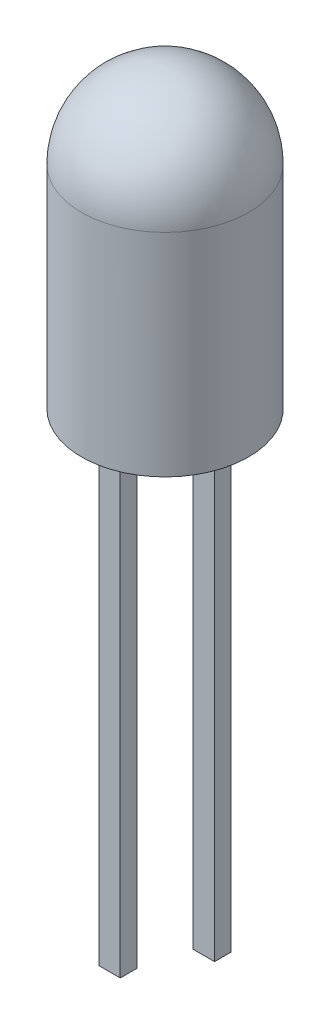
ISO-10303-21;
HEADER;
FILE_DESCRIPTION(('STEP AP214'),'2;1');
FILE_NAME('part.step','',(''),(''),'','','');
FILE_SCHEMA(('AUTOMOTIVE_DESIGN { 1 0 10303 214 1 1 1 1 }'));
ENDSEC;
DATA;
#1=APPLICATION_CONTEXT('core data for automotive mechanical design processes');
#2=APPLICATION_PROTOCOL_DEFINITION('international standard','automotive_design',2000,#1);
#3=PRODUCT_CONTEXT('',#1,'mechanical');
#4=PRODUCT('Part','Part','',(#3));
#5=PRODUCT_RELATED_PRODUCT_CATEGORY('part','',(#4));
#6=PRODUCT_DEFINITION_FORMATION('','',#4);
#7=PRODUCT_DEFINITION_CONTEXT('part definition',#1,'design');
#8=PRODUCT_DEFINITION('design','',#6,#7);
#9=PRODUCT_DEFINITION_SHAPE('','',#8);
#10=(LENGTH_UNIT() NAMED_UNIT(*) SI_UNIT(.MILLI.,.METRE.));
#11=(NAMED_UNIT(*) PLANE_ANGLE_UNIT() SI_UNIT($,.RADIAN.));
#12=(NAMED_UNIT(*) SI_UNIT($,.STERADIAN.) SOLID_ANGLE_UNIT());
#13=UNCERTAINTY_MEASURE_WITH_UNIT(LENGTH_MEASURE(1.E-05),#10,'distance_accuracy_value','');
#14=(GEOMETRIC_REPRESENTATION_CONTEXT(3) GLOBAL_UNCERTAINTY_ASSIGNED_CONTEXT((#13)) GLOBAL_UNIT_ASSIGNED_CONTEXT((#10,
#11,#12)) REPRESENTATION_CONTEXT('',''));
#15=CARTESIAN_POINT('',(0.,0.,0.));
#16=DIRECTION('',(0.,0.,1.));
#17=DIRECTION('',(1.,0.,0.));
#18=AXIS2_PLACEMENT_3D('',#15,#16,#17);
#19=CARTESIAN_POINT('',(-0.0605595659989582,2.80694027615572,0.));
#20=DIRECTION('',(0.,-1.,0.));
#21=DIRECTION('',(1.,0.,0.));
#22=AXIS2_PLACEMENT_3D('',#19,#20,#21);
#23=CYLINDRICAL_SURFACE('',#22,0.189425793844278);
#24=CARTESIAN_POINT('',(-0.0605595659989582,2.80694027615572,0.));
#25=DIRECTION('',(0.,1.,0.));
#26=DIRECTION('',(-1.,0.,0.));
#27=AXIS2_PLACEMENT_3D('',#24,#25,#26);
#28=CIRCLE('',#27,0.189425793844278);
#29=CARTESIAN_POINT('',(-0.249985359843236,2.80694027615572,0.));
#30=VERTEX_POINT('',#29);
#31=EDGE_CURVE('E11',#30,#30,#28,.T.);
#32=ORIENTED_EDGE('',*,*,#31,.F.);
#33=EDGE_LOOP('',(#32));
#34=FACE_BOUND('',#33,.T.);
#35=CARTESIAN_POINT('',(-0.0605595659989582,2.70694027615572,0.));
#36=DIRECTION('',(0.,1.,0.));
#37=DIRECTION('',(-1.,0.,0.));
#38=AXIS2_PLACEMENT_3D('',#35,#36,#37);
#39=CIRCLE('',#38,0.189425793844278);
#40=CARTESIAN_POINT('',(-0.249985359843236,2.70694027615572,0.));
#41=VERTEX_POINT('',#40);
#42=EDGE_CURVE('E52',#41,#41,#39,.T.);
#43=ORIENTED_EDGE('',*,*,#42,.T.);
#44=EDGE_LOOP('',(#43));
#45=FACE_BOUND('',#44,.T.);
#46=ADVANCED_FACE('F49',(#34,#45),#23,.T.);
#47=CARTESIAN_POINT('',(-0.0605595659989582,2.80694027615572,0.));
#48=DIRECTION('',(0.,1.,0.));
#49=DIRECTION('',(-1.,0.,0.));
#50=AXIS2_PLACEMENT_3D('',#47,#48,#49);
#51=PLANE('',#50);
#52=ORIENTED_EDGE('',*,*,#31,.T.);
#53=EDGE_LOOP('',(#52));
#54=FACE_BOUND('',#53,.T.);
#55=ADVANCED_FACE('F64',(#54),#51,.T.);
#56=CARTESIAN_POINT('',(-0.0605595659989582,2.70694027615572,0.));
#57=DIRECTION('',(0.,1.,0.));
#58=DIRECTION('',(-1.,0.,0.));
#59=AXIS2_PLACEMENT_3D('',#56,#57,#58);
#60=PLANE('',#59);
#61=ORIENTED_EDGE('',*,*,#42,.F.);
#62=EDGE_LOOP('',(#61));
#63=FACE_BOUND('',#62,.T.);
#64=ADVANCED_FACE('F62',(#63),#60,.F.);
#65=CLOSED_SHELL('',(#46,#55,#64));
#66=MANIFOLD_SOLID_BREP('B2',#65);
#67=CARTESIAN_POINT('',(0.654816514950922,-8.,0.149242281114547));
#68=DIRECTION('',(1.,0.,0.));
#69=DIRECTION('',(0.,0.,-1.));
#70=AXIS2_PLACEMENT_3D('',#67,#68,#69);
#71=PLANE('',#70);
#72=DIRECTION('',(0.,1.,0.));
#73=VECTOR('',#72,1.);
#74=CARTESIAN_POINT('',(0.654816514950922,-8.,0.149242281114547));
#75=LINE('',#74,#73);
#76=CARTESIAN_POINT('',(0.654816514950922,-8.,0.149242281114547));
#77=VERTEX_POINT('',#76);
#78=CARTESIAN_POINT('',(0.654816514950922,0.,0.149242281114547));
#79=VERTEX_POINT('',#78);
#80=EDGE_CURVE('E495',#77,#79,#75,.T.);
#81=ORIENTED_EDGE('',*,*,#80,.T.);
#82=DIRECTION('',(0.,0.,-1.));
#83=VECTOR('',#82,1.);
#84=CARTESIAN_POINT('',(0.654816514950922,0.,0.15));
#85=LINE('',#84,#83);
#86=CARTESIAN_POINT('',(0.654816514950922,0.,0.15));
#87=VERTEX_POINT('',#86);
#88=EDGE_CURVE('E251',#87,#79,#85,.T.);
#89=ORIENTED_EDGE('',*,*,#88,.F.);
#90=DIRECTION('',(0.,-1.,0.));
#91=VECTOR('',#90,1.);
#92=CARTESIAN_POINT('',(0.654816514950922,1.55125542870119,0.15));
#93=LINE('',#92,#91);
#94=CARTESIAN_POINT('',(0.654816514950922,1.55125542870119,0.15));
#95=VERTEX_POINT('',#94);
#96=EDGE_CURVE('E325',#95,#87,#93,.T.);
#97=ORIENTED_EDGE('',*,*,#96,.F.);
#98=DIRECTION('',(0.,0.,-1.));
#99=VECTOR('',#98,1.);
#100=CARTESIAN_POINT('',(0.654816514950922,1.55125542870119,0.15));
#101=LINE('',#100,#99);
#102=CARTESIAN_POINT('',(0.654816514950922,1.55125542870119,-0.15));
#103=VERTEX_POINT('',#102);
#104=EDGE_CURVE('E246',#95,#103,#101,.T.);
#105=ORIENTED_EDGE('',*,*,#104,.T.);
#106=DIRECTION('',(0.,-1.,0.));
#107=VECTOR('',#106,1.);
#108=CARTESIAN_POINT('',(0.654816514950922,1.55125542870119,-0.15));
#109=LINE('',#108,#107);
#110=CARTESIAN_POINT('',(0.654816514950922,0.,-0.15));
#111=VERTEX_POINT('',#110);
#112=EDGE_CURVE('E269',#103,#111,#109,.T.);
#113=ORIENTED_EDGE('',*,*,#112,.T.);
#114=CARTESIAN_POINT('',(0.654816514950922,0.,-0.149242281114547));
#115=VERTEX_POINT('',#114);
#116=EDGE_CURVE('E235',#115,#111,#85,.T.);
#117=ORIENTED_EDGE('',*,*,#116,.F.);
#118=DIRECTION('',(0.,1.,0.));
#119=VECTOR('',#118,1.);
#120=CARTESIAN_POINT('',(0.654816514950922,-8.,-0.149242281114547));
#121=LINE('',#120,#119);
#122=CARTESIAN_POINT('',(0.654816514950922,-8.,-0.149242281114547));
#123=VERTEX_POINT('',#122);
#124=EDGE_CURVE('E47',#123,#115,#121,.T.);
#125=ORIENTED_EDGE('',*,*,#124,.F.);
#126=DIRECTION('',(0.,0.,-1.));
#127=VECTOR('',#126,1.);
#128=CARTESIAN_POINT('',(0.654816514950922,-8.,0.149242281114547));
#129=LINE('',#128,#127);
#130=EDGE_CURVE('E486',#77,#123,#129,.T.);
#131=ORIENTED_EDGE('',*,*,#130,.F.);
#132=EDGE_LOOP('',(#81,#89,#97,#105,#113,#117,#125,#131));
#133=FACE_BOUND('',#132,.T.);
#134=ADVANCED_FACE('F99',(#133),#71,.F.);
#135=CARTESIAN_POINT('',(1.03787854119038,-8.,-0.149242281114547));
#136=DIRECTION('',(0.,0.,1.));
#137=DIRECTION('',(1.,0.,0.));
#138=AXIS2_PLACEMENT_3D('',#135,#136,#137);
#139=PLANE('',#138);
#140=DIRECTION('',(1.,0.,0.));
#141=VECTOR('',#140,1.);
#142=CARTESIAN_POINT('',(1.03787854119038,0.,-0.149242281114547));
#143=LINE('',#142,#141);
#144=CARTESIAN_POINT('',(1.03787854119038,0.,-0.149242281114547));
#145=VERTEX_POINT('',#144);
#146=EDGE_CURVE('E222',#115,#145,#143,.T.);
#147=ORIENTED_EDGE('',*,*,#146,.T.);
#148=DIRECTION('',(0.,1.,0.));
#149=VECTOR('',#148,1.);
#150=CARTESIAN_POINT('',(1.03787854119038,-8.,-0.149242281114547));
#151=LINE('',#150,#149);
#152=CARTESIAN_POINT('',(1.03787854119038,-8.,-0.149242281114547));
#153=VERTEX_POINT('',#152);
#154=EDGE_CURVE('E108',#153,#145,#151,.T.);
#155=ORIENTED_EDGE('',*,*,#154,.F.);
#156=DIRECTION('',(1.,0.,0.));
#157=VECTOR('',#156,1.);
#158=CARTESIAN_POINT('',(1.03787854119038,-8.,-0.149242281114547));
#159=LINE('',#158,#157);
#160=EDGE_CURVE('E487',#123,#153,#159,.T.);
#161=ORIENTED_EDGE('',*,*,#160,.F.);
#162=ORIENTED_EDGE('',*,*,#124,.T.);
#163=EDGE_LOOP('',(#147,#155,#161,#162));
#164=FACE_BOUND('',#163,.T.);
#165=ADVANCED_FACE('F352',(#164),#139,.F.);
#166=CARTESIAN_POINT('',(1.03787854119038,-8.,0.149242281114547));
#167=DIRECTION('',(-1.,0.,0.));
#168=DIRECTION('',(0.,0.,1.));
#169=AXIS2_PLACEMENT_3D('',#166,#167,#168);
#170=PLANE('',#169);
#171=ORIENTED_EDGE('',*,*,#154,.T.);
#172=DIRECTION('',(0.,0.,-1.));
#173=VECTOR('',#172,1.);
#174=CARTESIAN_POINT('',(1.03787854119038,0.,0.15));
#175=LINE('',#174,#173);
#176=CARTESIAN_POINT('',(1.03787854119038,0.,-0.15));
#177=VERTEX_POINT('',#176);
#178=EDGE_CURVE('E236',#145,#177,#175,.T.);
#179=ORIENTED_EDGE('',*,*,#178,.T.);
#180=DIRECTION('',(0.,1.,0.));
#181=VECTOR('',#180,1.);
#182=CARTESIAN_POINT('',(1.03787854119038,2.26044556615674,-0.15));
#183=LINE('',#182,#181);
#184=CARTESIAN_POINT('',(1.03787854119038,2.26044556615674,-0.15));
#185=VERTEX_POINT('',#184);
#186=EDGE_CURVE('E280',#177,#185,#183,.T.);
#187=ORIENTED_EDGE('',*,*,#186,.T.);
#188=DIRECTION('',(0.,0.,-1.));
#189=VECTOR('',#188,1.);
#190=CARTESIAN_POINT('',(1.03787854119038,2.26044556615674,0.15));
#191=LINE('',#190,#189);
#192=CARTESIAN_POINT('',(1.03787854119038,2.26044556615674,0.15));
#193=VERTEX_POINT('',#192);
#194=EDGE_CURVE('E241',#193,#185,#191,.T.);
#195=ORIENTED_EDGE('',*,*,#194,.F.);
#196=DIRECTION('',(0.,1.,0.));
#197=VECTOR('',#196,1.);
#198=CARTESIAN_POINT('',(1.03787854119038,1.55125542870119,0.15));
#199=LINE('',#198,#197);
#200=CARTESIAN_POINT('',(1.03787854119038,0.,0.15));
#201=VERTEX_POINT('',#200);
#202=EDGE_CURVE('E287',#201,#193,#199,.T.);
#203=ORIENTED_EDGE('',*,*,#202,.F.);
#204=CARTESIAN_POINT('',(1.03787854119038,0.,0.149242281114547));
#205=VERTEX_POINT('',#204);
#206=EDGE_CURVE('E231',#201,#205,#175,.T.);
#207=ORIENTED_EDGE('',*,*,#206,.T.);
#208=DIRECTION('',(0.,1.,0.));
#209=VECTOR('',#208,1.);
#210=CARTESIAN_POINT('',(1.03787854119038,-8.,0.149242281114547));
#211=LINE('',#210,#209);
#212=CARTESIAN_POINT('',(1.03787854119038,-8.,0.149242281114547));
#213=VERTEX_POINT('',#212);
#214=EDGE_CURVE('E501',#213,#205,#211,.T.);
#215=ORIENTED_EDGE('',*,*,#214,.F.);
#216=DIRECTION('',(0.,0.,1.));
#217=VECTOR('',#216,1.);
#218=CARTESIAN_POINT('',(1.03787854119038,-8.,0.149242281114547));
#219=LINE('',#218,#217);
#220=EDGE_CURVE('E490',#153,#213,#219,.T.);
#221=ORIENTED_EDGE('',*,*,#220,.F.);
#222=EDGE_LOOP('',(#171,#179,#187,#195,#203,#207,#215,#221));
#223=FACE_BOUND('',#222,.T.);
#224=ADVANCED_FACE('F338',(#223),#170,.F.);
#225=CARTESIAN_POINT('',(1.03787854119038,-8.,0.149242281114547));
#226=DIRECTION('',(0.,0.,-1.));
#227=DIRECTION('',(-1.,0.,0.));
#228=AXIS2_PLACEMENT_3D('',#225,#226,#227);
#229=PLANE('',#228);
#230=DIRECTION('',(-1.,0.,0.));
#231=VECTOR('',#230,1.);
#232=CARTESIAN_POINT('',(1.03787854119038,0.,0.149242281114547));
#233=LINE('',#232,#231);
#234=EDGE_CURVE('E225',#205,#79,#233,.T.);
#235=ORIENTED_EDGE('',*,*,#234,.T.);
#236=ORIENTED_EDGE('',*,*,#80,.F.);
#237=DIRECTION('',(-1.,0.,0.));
#238=VECTOR('',#237,1.);
#239=CARTESIAN_POINT('',(1.03787854119038,-8.,0.149242281114547));
#240=LINE('',#239,#238);
#241=EDGE_CURVE('E116',#213,#77,#240,.T.);
#242=ORIENTED_EDGE('',*,*,#241,.F.);
#243=ORIENTED_EDGE('',*,*,#214,.T.);
#244=EDGE_LOOP('',(#235,#236,#242,#243));
#245=FACE_BOUND('',#244,.T.);
#246=ADVANCED_FACE('F360',(#245),#229,.F.);
#247=CARTESIAN_POINT('',(0.,-8.,0.));
#248=DIRECTION('',(0.,1.,0.));
#249=DIRECTION('',(0.,0.,1.));
#250=AXIS2_PLACEMENT_3D('',#247,#248,#249);
#251=PLANE('',#250);
#252=ORIENTED_EDGE('',*,*,#130,.T.);
#253=ORIENTED_EDGE('',*,*,#160,.T.);
#254=ORIENTED_EDGE('',*,*,#220,.T.);
#255=ORIENTED_EDGE('',*,*,#241,.T.);
#256=EDGE_LOOP('',(#252,#253,#254,#255));
#257=FACE_BOUND('',#256,.T.);
#258=ADVANCED_FACE('F365',(#257),#251,.F.);
#259=CARTESIAN_POINT('',(1.03787854119038,0.,0.15));
#260=DIRECTION('',(0.,1.,0.));
#261=DIRECTION('',(0.,0.,1.));
#262=AXIS2_PLACEMENT_3D('',#259,#260,#261);
#263=PLANE('',#262);
#264=ORIENTED_EDGE('',*,*,#234,.F.);
#265=ORIENTED_EDGE('',*,*,#206,.F.);
#266=DIRECTION('',(1.,0.,0.));
#267=VECTOR('',#266,1.);
#268=CARTESIAN_POINT('',(1.03787854119038,0.,0.15));
#269=LINE('',#268,#267);
#270=EDGE_CURVE('E289',#87,#201,#269,.T.);
#271=ORIENTED_EDGE('',*,*,#270,.F.);
#272=ORIENTED_EDGE('',*,*,#88,.T.);
#273=EDGE_LOOP('',(#264,#265,#271,#272));
#274=FACE_BOUND('',#273,.T.);
#275=ADVANCED_FACE('F333',(#274),#263,.F.);
#276=CARTESIAN_POINT('',(0.23596965825384,2.70694027615572,0.15));
#277=DIRECTION('',(0.815238267293768,-0.57912569234999,0.));
#278=DIRECTION('',(0.57912569234999,0.815238267293768,0.));
#279=AXIS2_PLACEMENT_3D('',#276,#277,#278);
#280=PLANE('',#279);
#281=DIRECTION('',(-0.57912569234999,-0.815238267293768,0.));
#282=VECTOR('',#281,1.);
#283=CARTESIAN_POINT('',(0.23596965825384,2.70694027615572,-0.15));
#284=LINE('',#283,#282);
#285=CARTESIAN_POINT('',(0.29411762082703,2.78879546731892,-0.15));
#286=VERTEX_POINT('',#285);
#287=CARTESIAN_POINT('',(0.23596965825384,2.70694027615572,-0.15));
#288=VERTEX_POINT('',#287);
#289=EDGE_CURVE('E221',#286,#288,#284,.T.);
#290=ORIENTED_EDGE('',*,*,#289,.T.);
#291=DIRECTION('',(0.,0.,-1.));
#292=VECTOR('',#291,1.);
#293=CARTESIAN_POINT('',(0.23596965825384,2.70694027615572,0.15));
#294=LINE('',#293,#292);
#295=CARTESIAN_POINT('',(0.23596965825384,2.70694027615572,0.15));
#296=VERTEX_POINT('',#295);
#297=EDGE_CURVE('E201',#296,#288,#294,.T.);
#298=ORIENTED_EDGE('',*,*,#297,.F.);
#299=DIRECTION('',(-0.57912569234999,-0.815238267293768,0.));
#300=VECTOR('',#299,1.);
#301=CARTESIAN_POINT('',(0.23596965825384,2.70694027615572,0.15));
#302=LINE('',#301,#300);
#303=CARTESIAN_POINT('',(0.29411762082703,2.78879546731892,0.15));
#304=VERTEX_POINT('',#303);
#305=EDGE_CURVE('E208',#304,#296,#302,.T.);
#306=ORIENTED_EDGE('',*,*,#305,.F.);
#307=DIRECTION('',(0.,0.,-1.));
#308=VECTOR('',#307,1.);
#309=CARTESIAN_POINT('',(0.29411762082703,2.78879546731892,0.15));
#310=LINE('',#309,#308);
#311=EDGE_CURVE('E285',#304,#286,#310,.T.);
#312=ORIENTED_EDGE('',*,*,#311,.T.);
#313=EDGE_LOOP('',(#290,#298,#306,#312));
#314=FACE_BOUND('',#313,.T.);
#315=ADVANCED_FACE('F219',(#314),#280,.F.);
#316=CARTESIAN_POINT('',(-0.385685641410784,2.70694027615572,0.15));
#317=DIRECTION('',(0.,-1.,0.));
#318=DIRECTION('',(1.,0.,0.));
#319=AXIS2_PLACEMENT_3D('',#316,#317,#318);
#320=PLANE('',#319);
#321=DIRECTION('',(-1.,0.,0.));
#322=VECTOR('',#321,1.);
#323=CARTESIAN_POINT('',(-0.385685641410784,2.70694027615572,-0.15));
#324=LINE('',#323,#322);
#325=CARTESIAN_POINT('',(-0.385685641410784,2.70694027615572,-0.15));
#326=VERTEX_POINT('',#325);
#327=EDGE_CURVE('E294',#288,#326,#324,.T.);
#328=ORIENTED_EDGE('',*,*,#327,.T.);
#329=DIRECTION('',(0.,0.,-1.));
#330=VECTOR('',#329,1.);
#331=CARTESIAN_POINT('',(-0.385685641410784,2.70694027615572,0.15));
#332=LINE('',#331,#330);
#333=CARTESIAN_POINT('',(-0.385685641410784,2.70694027615572,0.15));
#334=VERTEX_POINT('',#333);
#335=EDGE_CURVE('E204',#334,#326,#332,.T.);
#336=ORIENTED_EDGE('',*,*,#335,.F.);
#337=DIRECTION('',(-1.,0.,0.));
#338=VECTOR('',#337,1.);
#339=CARTESIAN_POINT('',(-0.385685641410784,2.70694027615572,0.15));
#340=LINE('',#339,#338);
#341=EDGE_CURVE('E197',#296,#334,#340,.T.);
#342=ORIENTED_EDGE('',*,*,#341,.F.);
#343=ORIENTED_EDGE('',*,*,#297,.T.);
#344=EDGE_LOOP('',(#328,#336,#342,#343));
#345=FACE_BOUND('',#344,.T.);
#346=ADVANCED_FACE('F199',(#345),#320,.F.);
#347=CARTESIAN_POINT('',(-0.512741887489072,2.79672069741169,0.15));
#348=DIRECTION('',(-0.57708493627475,-0.816684134978002,0.));
#349=DIRECTION('',(0.816684134978002,-0.57708493627475,0.));
#350=AXIS2_PLACEMENT_3D('',#347,#348,#349);
#351=PLANE('',#350);
#352=DIRECTION('',(-0.816684134978002,0.57708493627475,0.));
#353=VECTOR('',#352,1.);
#354=CARTESIAN_POINT('',(-0.512741887489072,2.79672069741169,-0.15));
#355=LINE('',#354,#353);
#356=CARTESIAN_POINT('',(-0.512741887489072,2.79672069741169,-0.15));
#357=VERTEX_POINT('',#356);
#358=EDGE_CURVE('E296',#326,#357,#355,.T.);
#359=ORIENTED_EDGE('',*,*,#358,.T.);
#360=DIRECTION('',(0.,0.,-1.));
#361=VECTOR('',#360,1.);
#362=CARTESIAN_POINT('',(-0.512741887489072,2.79672069741169,0.15));
#363=LINE('',#362,#361);
#364=CARTESIAN_POINT('',(-0.512741887489072,2.79672069741169,0.15));
#365=VERTEX_POINT('',#364);
#366=EDGE_CURVE('E227',#365,#357,#363,.T.);
#367=ORIENTED_EDGE('',*,*,#366,.F.);
#368=DIRECTION('',(-0.816684134978002,0.57708493627475,0.));
#369=VECTOR('',#368,1.);
#370=CARTESIAN_POINT('',(-0.512741887489072,2.79672069741169,0.15));
#371=LINE('',#370,#369);
#372=EDGE_CURVE('E207',#334,#365,#371,.T.);
#373=ORIENTED_EDGE('',*,*,#372,.F.);
#374=ORIENTED_EDGE('',*,*,#335,.T.);
#375=EDGE_LOOP('',(#359,#367,#373,#374));
#376=FACE_BOUND('',#375,.T.);
#377=ADVANCED_FACE('F342',(#376),#351,.F.);
#378=CARTESIAN_POINT('',(-0.565939224682698,2.79672069741169,0.15));
#379=DIRECTION('',(0.,-1.,0.));
#380=DIRECTION('',(0.,0.,-1.));
#381=AXIS2_PLACEMENT_3D('',#378,#379,#380);
#382=PLANE('',#381);
#383=DIRECTION('',(-1.,0.,0.));
#384=VECTOR('',#383,1.);
#385=CARTESIAN_POINT('',(-0.565939224682698,2.79672069741169,-0.15));
#386=LINE('',#385,#384);
#387=CARTESIAN_POINT('',(-0.565939224682698,2.79672069741169,-0.15));
#388=VERTEX_POINT('',#387);
#389=EDGE_CURVE('E298',#357,#388,#386,.T.);
#390=ORIENTED_EDGE('',*,*,#389,.T.);
#391=DIRECTION('',(0.,0.,-1.));
#392=VECTOR('',#391,1.);
#393=CARTESIAN_POINT('',(-0.565939224682698,2.79672069741169,0.15));
#394=LINE('',#393,#392);
#395=CARTESIAN_POINT('',(-0.565939224682698,2.79672069741169,0.15));
#396=VERTEX_POINT('',#395);
#397=EDGE_CURVE('E316',#396,#388,#394,.T.);
#398=ORIENTED_EDGE('',*,*,#397,.F.);
#399=DIRECTION('',(-1.,0.,0.));
#400=VECTOR('',#399,1.);
#401=CARTESIAN_POINT('',(-0.565939224682698,2.79672069741169,0.15));
#402=LINE('',#401,#400);
#403=EDGE_CURVE('E323',#365,#396,#402,.T.);
#404=ORIENTED_EDGE('',*,*,#403,.F.);
#405=ORIENTED_EDGE('',*,*,#366,.T.);
#406=EDGE_LOOP('',(#390,#398,#404,#405));
#407=FACE_BOUND('',#406,.T.);
#408=ADVANCED_FACE('F314',(#407),#382,.F.);
#409=CARTESIAN_POINT('',(-0.565939224682698,2.61715985489974,0.15));
#410=DIRECTION('',(1.,0.,0.));
#411=DIRECTION('',(0.,0.,-1.));
#412=AXIS2_PLACEMENT_3D('',#409,#410,#411);
#413=PLANE('',#412);
#414=DIRECTION('',(0.,-1.,0.));
#415=VECTOR('',#414,1.);
#416=CARTESIAN_POINT('',(-0.565939224682698,2.61715985489974,-0.15));
#417=LINE('',#416,#415);
#418=CARTESIAN_POINT('',(-0.565939224682698,2.41845099749163,-0.15));
#419=VERTEX_POINT('',#418);
#420=EDGE_CURVE('E301',#388,#419,#417,.T.);
#421=ORIENTED_EDGE('',*,*,#420,.T.);
#422=DIRECTION('',(0.,0.,-1.));
#423=VECTOR('',#422,1.);
#424=CARTESIAN_POINT('',(-0.565939224682698,2.41845099749163,0.15));
#425=LINE('',#424,#423);
#426=CARTESIAN_POINT('',(-0.565939224682698,2.41845099749163,0.15));
#427=VERTEX_POINT('',#426);
#428=EDGE_CURVE('E257',#427,#419,#425,.T.);
#429=ORIENTED_EDGE('',*,*,#428,.F.);
#430=DIRECTION('',(0.,-1.,0.));
#431=VECTOR('',#430,1.);
#432=CARTESIAN_POINT('',(-0.565939224682698,2.61715985489974,0.15));
#433=LINE('',#432,#431);
#434=EDGE_CURVE('E320',#396,#427,#433,.T.);
#435=ORIENTED_EDGE('',*,*,#434,.F.);
#436=ORIENTED_EDGE('',*,*,#397,.T.);
#437=EDGE_LOOP('',(#421,#429,#435,#436));
#438=FACE_BOUND('',#437,.T.);
#439=ADVANCED_FACE('F319',(#438),#413,.F.);
#440=CARTESIAN_POINT('',(0.654816514950922,1.55125542870119,0.15));
#441=DIRECTION('',(0.579125692349992,0.815238267293766,0.));
#442=DIRECTION('',(-0.815238267293766,0.579125692349992,0.));
#443=AXIS2_PLACEMENT_3D('',#440,#441,#442);
#444=PLANE('',#443);
#445=DIRECTION('',(0.815238267293766,-0.579125692349992,0.));
#446=VECTOR('',#445,1.);
#447=CARTESIAN_POINT('',(0.654816514950922,1.55125542870119,-0.15));
#448=LINE('',#447,#446);
#449=EDGE_CURVE('E275',#419,#103,#448,.T.);
#450=ORIENTED_EDGE('',*,*,#449,.T.);
#451=ORIENTED_EDGE('',*,*,#104,.F.);
#452=DIRECTION('',(0.815238267293766,-0.579125692349992,0.));
#453=VECTOR('',#452,1.);
#454=CARTESIAN_POINT('',(0.654816514950922,1.55125542870119,0.15));
#455=LINE('',#454,#453);
#456=EDGE_CURVE('E322',#427,#95,#455,.T.);
#457=ORIENTED_EDGE('',*,*,#456,.F.);
#458=ORIENTED_EDGE('',*,*,#428,.T.);
#459=EDGE_LOOP('',(#450,#451,#457,#458));
#460=FACE_BOUND('',#459,.T.);
#461=ADVANCED_FACE('F304',(#460),#444,.F.);
#462=ORIENTED_EDGE('',*,*,#146,.F.);
#463=ORIENTED_EDGE('',*,*,#116,.T.);
#464=DIRECTION('',(1.,0.,0.));
#465=VECTOR('',#464,1.);
#466=CARTESIAN_POINT('',(1.03787854119038,0.,-0.15));
#467=LINE('',#466,#465);
#468=EDGE_CURVE('E265',#111,#177,#467,.T.);
#469=ORIENTED_EDGE('',*,*,#468,.T.);
#470=ORIENTED_EDGE('',*,*,#178,.F.);
#471=EDGE_LOOP('',(#462,#463,#469,#470));
#472=FACE_BOUND('',#471,.T.);
#473=ADVANCED_FACE('F262',(#472),#263,.F.);
#474=CARTESIAN_POINT('',(1.03787854119038,2.26044556615674,0.15));
#475=DIRECTION('',(-0.579125692349993,-0.815238267293766,0.));
#476=DIRECTION('',(0.815238267293766,-0.579125692349993,0.));
#477=AXIS2_PLACEMENT_3D('',#474,#475,#476);
#478=PLANE('',#477);
#479=DIRECTION('',(-0.815238267293766,0.579125692349993,0.));
#480=VECTOR('',#479,1.);
#481=CARTESIAN_POINT('',(1.03787854119038,2.26044556615674,-0.15));
#482=LINE('',#481,#480);
#483=EDGE_CURVE('E217',#185,#286,#482,.T.);
#484=ORIENTED_EDGE('',*,*,#483,.T.);
#485=ORIENTED_EDGE('',*,*,#311,.F.);
#486=DIRECTION('',(-0.815238267293766,0.579125692349993,0.));
#487=VECTOR('',#486,1.);
#488=CARTESIAN_POINT('',(1.03787854119038,2.26044556615674,0.15));
#489=LINE('',#488,#487);
#490=EDGE_CURVE('E213',#193,#304,#489,.T.);
#491=ORIENTED_EDGE('',*,*,#490,.F.);
#492=ORIENTED_EDGE('',*,*,#194,.T.);
#493=EDGE_LOOP('',(#484,#485,#491,#492));
#494=FACE_BOUND('',#493,.T.);
#495=ADVANCED_FACE('F340',(#494),#478,.F.);
#496=CARTESIAN_POINT('',(0.,0.,0.15));
#497=DIRECTION('',(0.,0.,1.));
#498=DIRECTION('',(1.,0.,0.));
#499=AXIS2_PLACEMENT_3D('',#496,#497,#498);
#500=PLANE('',#499);
#501=ORIENTED_EDGE('',*,*,#305,.T.);
#502=ORIENTED_EDGE('',*,*,#341,.T.);
#503=ORIENTED_EDGE('',*,*,#372,.T.);
#504=ORIENTED_EDGE('',*,*,#403,.T.);
#505=ORIENTED_EDGE('',*,*,#434,.T.);
#506=ORIENTED_EDGE('',*,*,#456,.T.);
#507=ORIENTED_EDGE('',*,*,#96,.T.);
#508=ORIENTED_EDGE('',*,*,#270,.T.);
#509=ORIENTED_EDGE('',*,*,#202,.T.);
#510=ORIENTED_EDGE('',*,*,#490,.T.);
#511=EDGE_LOOP('',(#501,#502,#503,#504,#505,#506,#507,#508,#509,#510));
#512=FACE_BOUND('',#511,.T.);
#513=ADVANCED_FACE('F211',(#512),#500,.T.);
#514=CARTESIAN_POINT('',(0.,0.,-0.15));
#515=DIRECTION('',(0.,0.,1.));
#516=DIRECTION('',(1.,0.,0.));
#517=AXIS2_PLACEMENT_3D('',#514,#515,#516);
#518=PLANE('',#517);
#519=ORIENTED_EDGE('',*,*,#289,.F.);
#520=ORIENTED_EDGE('',*,*,#483,.F.);
#521=ORIENTED_EDGE('',*,*,#186,.F.);
#522=ORIENTED_EDGE('',*,*,#468,.F.);
#523=ORIENTED_EDGE('',*,*,#112,.F.);
#524=ORIENTED_EDGE('',*,*,#449,.F.);
#525=ORIENTED_EDGE('',*,*,#420,.F.);
#526=ORIENTED_EDGE('',*,*,#389,.F.);
#527=ORIENTED_EDGE('',*,*,#358,.F.);
#528=ORIENTED_EDGE('',*,*,#327,.F.);
#529=EDGE_LOOP('',(#519,#520,#521,#522,#523,#524,#525,#526,#527,#528));
#530=FACE_BOUND('',#529,.T.);
#531=ADVANCED_FACE('F278',(#530),#518,.F.);
#532=CLOSED_SHELL('',(#134,#165,#224,#246,#258,#275,#315,#346,#377,#408,#439,#461,#473,#495,
#513,#531));
#533=MANIFOLD_SOLID_BREP('B6',#532);
#534=CARTESIAN_POINT('',(-0.654816514950922,-8.,0.149242281114546));
#535=DIRECTION('',(-1.,0.,0.));
#536=DIRECTION('',(0.,0.,1.));
#537=AXIS2_PLACEMENT_3D('',#534,#535,#536);
#538=PLANE('',#537);
#539=DIRECTION('',(0.,1.,0.));
#540=VECTOR('',#539,1.);
#541=CARTESIAN_POINT('',(-0.654816514950922,-8.,-0.149242281114547));
#542=LINE('',#541,#540);
#543=CARTESIAN_POINT('',(-0.654816514950922,-9.1,-0.149242281114547));
#544=VERTEX_POINT('',#543);
#545=CARTESIAN_POINT('',(-0.654816514950922,0.,-0.149242281114547));
#546=VERTEX_POINT('',#545);
#547=EDGE_CURVE('E602',#544,#546,#542,.T.);
#548=ORIENTED_EDGE('',*,*,#547,.T.);
#549=DIRECTION('',(0.,0.,-1.));
#550=VECTOR('',#549,1.);
#551=CARTESIAN_POINT('',(-0.654816514950922,0.,0.15));
#552=LINE('',#551,#550);
#553=CARTESIAN_POINT('',(-0.654816514950922,0.,-0.15));
#554=VERTEX_POINT('',#553);
#555=EDGE_CURVE('E674',#546,#554,#552,.T.);
#556=ORIENTED_EDGE('',*,*,#555,.T.);
#557=DIRECTION('',(0.,1.,0.));
#558=VECTOR('',#557,1.);
#559=CARTESIAN_POINT('',(-0.654816514950922,0.,-0.15));
#560=LINE('',#559,#558);
#561=CARTESIAN_POINT('',(-0.654816514950922,1.55125542870119,-0.15));
#562=VERTEX_POINT('',#561);
#563=EDGE_CURVE('E648',#554,#562,#560,.T.);
#564=ORIENTED_EDGE('',*,*,#563,.T.);
#565=DIRECTION('',(0.,0.,-1.));
#566=VECTOR('',#565,1.);
#567=CARTESIAN_POINT('',(-0.654816514950922,1.55125542870119,0.15));
#568=LINE('',#567,#566);
#569=CARTESIAN_POINT('',(-0.654816514950922,1.55125542870119,0.15));
#570=VERTEX_POINT('',#569);
#571=EDGE_CURVE('E671',#570,#562,#568,.T.);
#572=ORIENTED_EDGE('',*,*,#571,.F.);
#573=DIRECTION('',(0.,1.,0.));
#574=VECTOR('',#573,1.);
#575=CARTESIAN_POINT('',(-0.654816514950922,0.,0.15));
#576=LINE('',#575,#574);
#577=CARTESIAN_POINT('',(-0.654816514950922,0.,0.15));
#578=VERTEX_POINT('',#577);
#579=EDGE_CURVE('E634',#578,#570,#576,.T.);
#580=ORIENTED_EDGE('',*,*,#579,.F.);
#581=CARTESIAN_POINT('',(-0.654816514950922,0.,0.149242281114546));
#582=VERTEX_POINT('',#581);
#583=EDGE_CURVE('E682',#578,#582,#552,.T.);
#584=ORIENTED_EDGE('',*,*,#583,.T.);
#585=DIRECTION('',(0.,1.,0.));
#586=VECTOR('',#585,1.);
#587=CARTESIAN_POINT('',(-0.654816514950922,-8.,0.149242281114546));
#588=LINE('',#587,#586);
#589=CARTESIAN_POINT('',(-0.654816514950922,-9.1,0.149242281114546));
#590=VERTEX_POINT('',#589);
#591=EDGE_CURVE('E97',#590,#582,#588,.T.);
#592=ORIENTED_EDGE('',*,*,#591,.F.);
#593=DIRECTION('',(0.,0.,1.));
#594=VECTOR('',#593,1.);
#595=CARTESIAN_POINT('',(-0.654816514950922,-9.1,-0.149242281114547));
#596=LINE('',#595,#594);
#597=EDGE_CURVE('E612',#544,#590,#596,.T.);
#598=ORIENTED_EDGE('',*,*,#597,.F.);
#599=EDGE_LOOP('',(#548,#556,#564,#572,#580,#584,#592,#598));
#600=FACE_BOUND('',#599,.T.);
#601=ADVANCED_FACE('F518',(#600),#538,.F.);
#602=CARTESIAN_POINT('',(-1.03787854119038,-8.,0.149242281114546));
#603=DIRECTION('',(0.,0.,-1.));
#604=DIRECTION('',(-1.,0.,0.));
#605=AXIS2_PLACEMENT_3D('',#602,#603,#604);
#606=PLANE('',#605);
#607=DIRECTION('',(-1.,0.,0.));
#608=VECTOR('',#607,1.);
#609=CARTESIAN_POINT('',(-1.03787854119038,0.,0.149242281114546));
#610=LINE('',#609,#608);
#611=CARTESIAN_POINT('',(-1.03787854119038,0.,0.149242281114546));
#612=VERTEX_POINT('',#611);
#613=EDGE_CURVE('E710',#582,#612,#610,.T.);
#614=ORIENTED_EDGE('',*,*,#613,.T.);
#615=DIRECTION('',(0.,1.,0.));
#616=VECTOR('',#615,1.);
#617=CARTESIAN_POINT('',(-1.03787854119038,-8.,0.149242281114546));
#618=LINE('',#617,#616);
#619=CARTESIAN_POINT('',(-1.03787854119038,-9.1,0.149242281114546));
#620=VERTEX_POINT('',#619);
#621=EDGE_CURVE('E526',#620,#612,#618,.T.);
#622=ORIENTED_EDGE('',*,*,#621,.F.);
#623=DIRECTION('',(-1.,0.,0.));
#624=VECTOR('',#623,1.);
#625=CARTESIAN_POINT('',(-0.654816514950922,-9.1,0.149242281114546));
#626=LINE('',#625,#624);
#627=EDGE_CURVE('E617',#590,#620,#626,.T.);
#628=ORIENTED_EDGE('',*,*,#627,.F.);
#629=ORIENTED_EDGE('',*,*,#591,.T.);
#630=EDGE_LOOP('',(#614,#622,#628,#629));
#631=FACE_BOUND('',#630,.T.);
#632=ADVANCED_FACE('F744',(#631),#606,.F.);
#633=CARTESIAN_POINT('',(-1.03787854119038,-8.,0.149242281114546));
#634=DIRECTION('',(1.,0.,0.));
#635=DIRECTION('',(0.,0.,-1.));
#636=AXIS2_PLACEMENT_3D('',#633,#634,#635);
#637=PLANE('',#636);
#638=ORIENTED_EDGE('',*,*,#621,.T.);
#639=DIRECTION('',(0.,0.,-1.));
#640=VECTOR('',#639,1.);
#641=CARTESIAN_POINT('',(-1.03787854119038,0.,0.15));
#642=LINE('',#641,#640);
#643=CARTESIAN_POINT('',(-1.03787854119038,0.,0.15));
#644=VERTEX_POINT('',#643);
#645=EDGE_CURVE('E534',#644,#612,#642,.T.);
#646=ORIENTED_EDGE('',*,*,#645,.F.);
#647=DIRECTION('',(0.,-1.,0.));
#648=VECTOR('',#647,1.);
#649=CARTESIAN_POINT('',(-1.03787854119038,1.55125542870119,0.15));
#650=LINE('',#649,#648);
#651=CARTESIAN_POINT('',(-1.03787854119038,2.61715985489974,0.15));
#652=VERTEX_POINT('',#651);
#653=EDGE_CURVE('E628',#652,#644,#650,.T.);
#654=ORIENTED_EDGE('',*,*,#653,.F.);
#655=DIRECTION('',(0.,0.,-1.));
#656=VECTOR('',#655,1.);
#657=CARTESIAN_POINT('',(-1.03787854119038,2.61715985489974,0.15));
#658=LINE('',#657,#656);
#659=CARTESIAN_POINT('',(-1.03787854119038,2.61715985489974,-0.15));
#660=VERTEX_POINT('',#659);
#661=EDGE_CURVE('E645',#652,#660,#658,.T.);
#662=ORIENTED_EDGE('',*,*,#661,.T.);
#663=DIRECTION('',(0.,-1.,0.));
#664=VECTOR('',#663,1.);
#665=CARTESIAN_POINT('',(-1.03787854119038,2.61715985489974,-0.15));
#666=LINE('',#665,#664);
#667=CARTESIAN_POINT('',(-1.03787854119038,0.,-0.15));
#668=VERTEX_POINT('',#667);
#669=EDGE_CURVE('E632',#660,#668,#666,.T.);
#670=ORIENTED_EDGE('',*,*,#669,.T.);
#671=CARTESIAN_POINT('',(-1.03787854119038,0.,-0.149242281114547));
#672=VERTEX_POINT('',#671);
#673=EDGE_CURVE('E683',#672,#668,#642,.T.);
#674=ORIENTED_EDGE('',*,*,#673,.F.);
#675=DIRECTION('',(0.,1.,0.));
#676=VECTOR('',#675,1.);
#677=CARTESIAN_POINT('',(-1.03787854119038,-8.,-0.149242281114547));
#678=LINE('',#677,#676);
#679=CARTESIAN_POINT('',(-1.03787854119038,-9.1,-0.149242281114547));
#680=VERTEX_POINT('',#679);
#681=EDGE_CURVE('E609',#680,#672,#678,.T.);
#682=ORIENTED_EDGE('',*,*,#681,.F.);
#683=DIRECTION('',(0.,0.,-1.));
#684=VECTOR('',#683,1.);
#685=CARTESIAN_POINT('',(-1.03787854119038,-9.1,0.149242281114546));
#686=LINE('',#685,#684);
#687=EDGE_CURVE('E622',#620,#680,#686,.T.);
#688=ORIENTED_EDGE('',*,*,#687,.F.);
#689=EDGE_LOOP('',(#638,#646,#654,#662,#670,#674,#682,#688));
#690=FACE_BOUND('',#689,.T.);
#691=ADVANCED_FACE('F727',(#690),#637,.F.);
#692=CARTESIAN_POINT('',(-1.03787854119038,-8.,-0.149242281114547));
#693=DIRECTION('',(0.,0.,1.));
#694=DIRECTION('',(1.,0.,0.));
#695=AXIS2_PLACEMENT_3D('',#692,#693,#694);
#696=PLANE('',#695);
#697=DIRECTION('',(1.,0.,0.));
#698=VECTOR('',#697,1.);
#699=CARTESIAN_POINT('',(-1.03787854119038,0.,-0.149242281114547));
#700=LINE('',#699,#698);
#701=EDGE_CURVE('E542',#672,#546,#700,.T.);
#702=ORIENTED_EDGE('',*,*,#701,.T.);
#703=ORIENTED_EDGE('',*,*,#547,.F.);
#704=DIRECTION('',(1.,0.,0.));
#705=VECTOR('',#704,1.);
#706=CARTESIAN_POINT('',(-1.03787854119038,-9.1,-0.149242281114547));
#707=LINE('',#706,#705);
#708=EDGE_CURVE('E607',#680,#544,#707,.T.);
#709=ORIENTED_EDGE('',*,*,#708,.F.);
#710=ORIENTED_EDGE('',*,*,#681,.T.);
#711=EDGE_LOOP('',(#702,#703,#709,#710));
#712=FACE_BOUND('',#711,.T.);
#713=ADVANCED_FACE('F604',(#712),#696,.F.);
#714=CARTESIAN_POINT('',(-1.03787854119038,0.,0.15));
#715=DIRECTION('',(0.,1.,0.));
#716=DIRECTION('',(0.,0.,1.));
#717=AXIS2_PLACEMENT_3D('',#714,#715,#716);
#718=PLANE('',#717);
#719=ORIENTED_EDGE('',*,*,#701,.F.);
#720=ORIENTED_EDGE('',*,*,#673,.T.);
#721=DIRECTION('',(1.,0.,0.));
#722=VECTOR('',#721,1.);
#723=CARTESIAN_POINT('',(-1.03787854119038,0.,-0.15));
#724=LINE('',#723,#722);
#725=EDGE_CURVE('E627',#668,#554,#724,.T.);
#726=ORIENTED_EDGE('',*,*,#725,.T.);
#727=ORIENTED_EDGE('',*,*,#555,.F.);
#728=EDGE_LOOP('',(#719,#720,#726,#727));
#729=FACE_BOUND('',#728,.T.);
#730=ADVANCED_FACE('F690',(#729),#718,.F.);
#731=ORIENTED_EDGE('',*,*,#613,.F.);
#732=ORIENTED_EDGE('',*,*,#583,.F.);
#733=DIRECTION('',(1.,0.,0.));
#734=VECTOR('',#733,1.);
#735=CARTESIAN_POINT('',(-1.03787854119038,0.,0.15));
#736=LINE('',#735,#734);
#737=EDGE_CURVE('E631',#644,#578,#736,.T.);
#738=ORIENTED_EDGE('',*,*,#737,.F.);
#739=ORIENTED_EDGE('',*,*,#645,.T.);
#740=EDGE_LOOP('',(#731,#732,#738,#739));
#741=FACE_BOUND('',#740,.T.);
#742=ADVANCED_FACE('F709',(#741),#718,.F.);
#743=CARTESIAN_POINT('',(0.482142428269985,1.55125542870119,0.15));
#744=DIRECTION('',(0.,1.,0.));
#745=DIRECTION('',(0.,0.,1.));
#746=AXIS2_PLACEMENT_3D('',#743,#744,#745);
#747=PLANE('',#746);
#748=DIRECTION('',(1.,0.,0.));
#749=VECTOR('',#748,1.);
#750=CARTESIAN_POINT('',(0.482142428269985,1.55125542870119,-0.15));
#751=LINE('',#750,#749);
#752=CARTESIAN_POINT('',(0.482142428269985,1.55125542870119,-0.15));
#753=VERTEX_POINT('',#752);
#754=EDGE_CURVE('E650',#562,#753,#751,.T.);
#755=ORIENTED_EDGE('',*,*,#754,.T.);
#756=DIRECTION('',(0.,0.,-1.));
#757=VECTOR('',#756,1.);
#758=CARTESIAN_POINT('',(0.482142428269985,1.55125542870119,0.15));
#759=LINE('',#758,#757);
#760=CARTESIAN_POINT('',(0.482142428269985,1.55125542870119,0.15));
#761=VERTEX_POINT('',#760);
#762=EDGE_CURVE('E668',#761,#753,#759,.T.);
#763=ORIENTED_EDGE('',*,*,#762,.F.);
#764=DIRECTION('',(1.,0.,0.));
#765=VECTOR('',#764,1.);
#766=CARTESIAN_POINT('',(0.482142428269985,1.55125542870119,0.15));
#767=LINE('',#766,#765);
#768=EDGE_CURVE('E636',#570,#761,#767,.T.);
#769=ORIENTED_EDGE('',*,*,#768,.F.);
#770=ORIENTED_EDGE('',*,*,#571,.T.);
#771=EDGE_LOOP('',(#755,#763,#769,#770));
#772=FACE_BOUND('',#771,.T.);
#773=ADVANCED_FACE('F699',(#772),#747,.F.);
#774=CARTESIAN_POINT('',(0.482142428269985,1.55125542870119,0.15));
#775=DIRECTION('',(-0.579125692349992,-0.815238267293766,0.));
#776=DIRECTION('',(0.815238267293766,-0.579125692349993,0.));
#777=AXIS2_PLACEMENT_3D('',#774,#775,#776);
#778=PLANE('',#777);
#779=DIRECTION('',(-0.815238267293766,0.579125692349992,0.));
#780=VECTOR('',#779,1.);
#781=CARTESIAN_POINT('',(0.482142428269985,1.55125542870119,-0.15));
#782=LINE('',#781,#780);
#783=CARTESIAN_POINT('',(-0.665939224682699,2.36682507111711,-0.15));
#784=VERTEX_POINT('',#783);
#785=EDGE_CURVE('E652',#753,#784,#782,.T.);
#786=ORIENTED_EDGE('',*,*,#785,.T.);
#787=DIRECTION('',(0.,0.,-1.));
#788=VECTOR('',#787,1.);
#789=CARTESIAN_POINT('',(-0.665939224682699,2.36682507111711,0.15));
#790=LINE('',#789,#788);
#791=CARTESIAN_POINT('',(-0.665939224682699,2.36682507111711,0.15));
#792=VERTEX_POINT('',#791);
#793=EDGE_CURVE('E665',#792,#784,#790,.T.);
#794=ORIENTED_EDGE('',*,*,#793,.F.);
#795=DIRECTION('',(-0.815238267293766,0.579125692349992,0.));
#796=VECTOR('',#795,1.);
#797=CARTESIAN_POINT('',(0.482142428269985,1.55125542870119,0.15));
#798=LINE('',#797,#796);
#799=EDGE_CURVE('E638',#761,#792,#798,.T.);
#800=ORIENTED_EDGE('',*,*,#799,.F.);
#801=ORIENTED_EDGE('',*,*,#762,.T.);
#802=EDGE_LOOP('',(#786,#794,#800,#801));
#803=FACE_BOUND('',#802,.T.);
#804=ADVANCED_FACE('F703',(#803),#778,.F.);
#805=CARTESIAN_POINT('',(-0.665939224682699,2.61715985489974,0.15));
#806=DIRECTION('',(-1.,0.,0.));
#807=DIRECTION('',(0.,0.,1.));
#808=AXIS2_PLACEMENT_3D('',#805,#806,#807);
#809=PLANE('',#808);
#810=DIRECTION('',(0.,1.,0.));
#811=VECTOR('',#810,1.);
#812=CARTESIAN_POINT('',(-0.665939224682699,2.61715985489974,-0.15));
#813=LINE('',#812,#811);
#814=CARTESIAN_POINT('',(-0.665939224682699,2.61715985489974,-0.15));
#815=VERTEX_POINT('',#814);
#816=EDGE_CURVE('E654',#784,#815,#813,.T.);
#817=ORIENTED_EDGE('',*,*,#816,.T.);
#818=DIRECTION('',(0.,0.,-1.));
#819=VECTOR('',#818,1.);
#820=CARTESIAN_POINT('',(-0.665939224682699,2.61715985489974,0.15));
#821=LINE('',#820,#819);
#822=CARTESIAN_POINT('',(-0.665939224682699,2.61715985489974,0.15));
#823=VERTEX_POINT('',#822);
#824=EDGE_CURVE('E662',#823,#815,#821,.T.);
#825=ORIENTED_EDGE('',*,*,#824,.F.);
#826=DIRECTION('',(0.,1.,0.));
#827=VECTOR('',#826,1.);
#828=CARTESIAN_POINT('',(-0.665939224682699,2.61715985489974,0.15));
#829=LINE('',#828,#827);
#830=EDGE_CURVE('E640',#792,#823,#829,.T.);
#831=ORIENTED_EDGE('',*,*,#830,.F.);
#832=ORIENTED_EDGE('',*,*,#793,.T.);
#833=EDGE_LOOP('',(#817,#825,#831,#832));
#834=FACE_BOUND('',#833,.T.);
#835=ADVANCED_FACE('F734',(#834),#809,.F.);
#836=CARTESIAN_POINT('',(-0.665939224682699,2.61715985489974,0.15));
#837=DIRECTION('',(0.,-1.,0.));
#838=DIRECTION('',(1.,0.,0.));
#839=AXIS2_PLACEMENT_3D('',#836,#837,#838);
#840=PLANE('',#839);
#841=DIRECTION('',(-1.,0.,0.));
#842=VECTOR('',#841,1.);
#843=CARTESIAN_POINT('',(-0.665939224682699,2.61715985489974,-0.15));
#844=LINE('',#843,#842);
#845=EDGE_CURVE('E656',#815,#660,#844,.T.);
#846=ORIENTED_EDGE('',*,*,#845,.T.);
#847=ORIENTED_EDGE('',*,*,#661,.F.);
#848=DIRECTION('',(-1.,0.,0.));
#849=VECTOR('',#848,1.);
#850=CARTESIAN_POINT('',(-0.665939224682699,2.61715985489974,0.15));
#851=LINE('',#850,#849);
#852=EDGE_CURVE('E642',#823,#652,#851,.T.);
#853=ORIENTED_EDGE('',*,*,#852,.F.);
#854=ORIENTED_EDGE('',*,*,#824,.T.);
#855=EDGE_LOOP('',(#846,#847,#853,#854));
#856=FACE_BOUND('',#855,.T.);
#857=ADVANCED_FACE('F731',(#856),#840,.F.);
#858=CARTESIAN_POINT('',(0.,0.,0.15));
#859=DIRECTION('',(0.,0.,1.));
#860=DIRECTION('',(1.,0.,0.));
#861=AXIS2_PLACEMENT_3D('',#858,#859,#860);
#862=PLANE('',#861);
#863=ORIENTED_EDGE('',*,*,#653,.T.);
#864=ORIENTED_EDGE('',*,*,#737,.T.);
#865=ORIENTED_EDGE('',*,*,#579,.T.);
#866=ORIENTED_EDGE('',*,*,#768,.T.);
#867=ORIENTED_EDGE('',*,*,#799,.T.);
#868=ORIENTED_EDGE('',*,*,#830,.T.);
#869=ORIENTED_EDGE('',*,*,#852,.T.);
#870=EDGE_LOOP('',(#863,#864,#865,#866,#867,#868,#869));
#871=FACE_BOUND('',#870,.T.);
#872=ADVANCED_FACE('F707',(#871),#862,.T.);
#873=CARTESIAN_POINT('',(0.,0.,-0.15));
#874=DIRECTION('',(0.,0.,1.));
#875=DIRECTION('',(1.,0.,0.));
#876=AXIS2_PLACEMENT_3D('',#873,#874,#875);
#877=PLANE('',#876);
#878=ORIENTED_EDGE('',*,*,#725,.F.);
#879=ORIENTED_EDGE('',*,*,#669,.F.);
#880=ORIENTED_EDGE('',*,*,#845,.F.);
#881=ORIENTED_EDGE('',*,*,#816,.F.);
#882=ORIENTED_EDGE('',*,*,#785,.F.);
#883=ORIENTED_EDGE('',*,*,#754,.F.);
#884=ORIENTED_EDGE('',*,*,#563,.F.);
#885=EDGE_LOOP('',(#878,#879,#880,#881,#882,#883,#884));
#886=FACE_BOUND('',#885,.T.);
#887=ADVANCED_FACE('F694',(#886),#877,.F.);
#888=CARTESIAN_POINT('',(0.,-9.1,0.));
#889=DIRECTION('',(0.,-1.,0.));
#890=DIRECTION('',(0.,0.,-1.));
#891=AXIS2_PLACEMENT_3D('',#888,#889,#890);
#892=PLANE('',#891);
#893=ORIENTED_EDGE('',*,*,#708,.T.);
#894=ORIENTED_EDGE('',*,*,#597,.T.);
#895=ORIENTED_EDGE('',*,*,#627,.T.);
#896=ORIENTED_EDGE('',*,*,#687,.T.);
#897=EDGE_LOOP('',(#893,#894,#895,#896));
#898=FACE_BOUND('',#897,.T.);
#899=ADVANCED_FACE('F620',(#898),#892,.T.);
#900=CLOSED_SHELL('',(#601,#632,#691,#713,#730,#742,#773,#804,#835,#857,#872,#887,#899));
#901=MANIFOLD_SOLID_BREP('B41',#900);
#902=CARTESIAN_POINT('',(0.,0.,0.));
#903=DIRECTION('',(0.,1.,0.));
#904=DIRECTION('',(0.,0.,1.));
#905=AXIS2_PLACEMENT_3D('',#902,#903,#904);
#906=PLANE('',#905);
#907=CARTESIAN_POINT('',(0.,0.,0.));
#908=DIRECTION('',(0.,-1.,0.));
#909=DIRECTION('',(0.,0.,-1.));
#910=AXIS2_PLACEMENT_3D('',#907,#908,#909);
#911=CIRCLE('',#910,1.5);
#912=CARTESIAN_POINT('',(0.,0.,-1.5));
#913=VERTEX_POINT('',#912);
#914=EDGE_CURVE('E517',#913,#913,#911,.T.);
#915=ORIENTED_EDGE('',*,*,#914,.T.);
#916=EDGE_LOOP('',(#915));
#917=FACE_BOUND('',#916,.T.);
#918=ADVANCED_FACE('F861',(#917),#906,.F.);
#919=CARTESIAN_POINT('',(0.,0.,0.));
#920=DIRECTION('',(0.,-1.,0.));
#921=DIRECTION('',(0.,0.,-1.));
#922=AXIS2_PLACEMENT_3D('',#919,#920,#921);
#923=CYLINDRICAL_SURFACE('',#922,1.5);
#924=ORIENTED_EDGE('',*,*,#914,.F.);
#925=EDGE_LOOP('',(#924));
#926=FACE_BOUND('',#925,.T.);
#927=CARTESIAN_POINT('',(0.,3.8,0.));
#928=DIRECTION('',(0.,-1.,0.));
#929=DIRECTION('',(0.,0.,-1.));
#930=AXIS2_PLACEMENT_3D('',#927,#928,#929);
#931=CIRCLE('',#930,1.5);
#932=CARTESIAN_POINT('',(0.,3.8,-1.5));
#933=VERTEX_POINT('',#932);
#934=EDGE_CURVE('E867',#933,#933,#931,.T.);
#935=ORIENTED_EDGE('',*,*,#934,.T.);
#936=EDGE_LOOP('',(#935));
#937=FACE_BOUND('',#936,.T.);
#938=ADVANCED_FACE('F873',(#926,#937),#923,.T.);
#939=CARTESIAN_POINT('',(0.,3.79999999999999,0.));
#940=DIRECTION('',(0.,-1.,0.));
#941=DIRECTION('',(-1.,0.,0.));
#942=AXIS2_PLACEMENT_3D('',#939,#940,#941);
#943=SPHERICAL_SURFACE('',#942,1.50000000000001);
#944=ORIENTED_EDGE('',*,*,#934,.F.);
#945=EDGE_LOOP('',(#944));
#946=FACE_BOUND('',#945,.T.);
#947=ADVANCED_FACE('F875',(#946),#943,.T.);
#948=CLOSED_SHELL('',(#918,#938,#947));
#949=MANIFOLD_SOLID_BREP('B91',#948);
#950=ADVANCED_BREP_SHAPE_REPRESENTATION('',(#18,#66,#533,#901,#949),#14);
#951=SHAPE_DEFINITION_REPRESENTATION(#9,#950);
ENDSEC;
END-ISO-10303-21;
